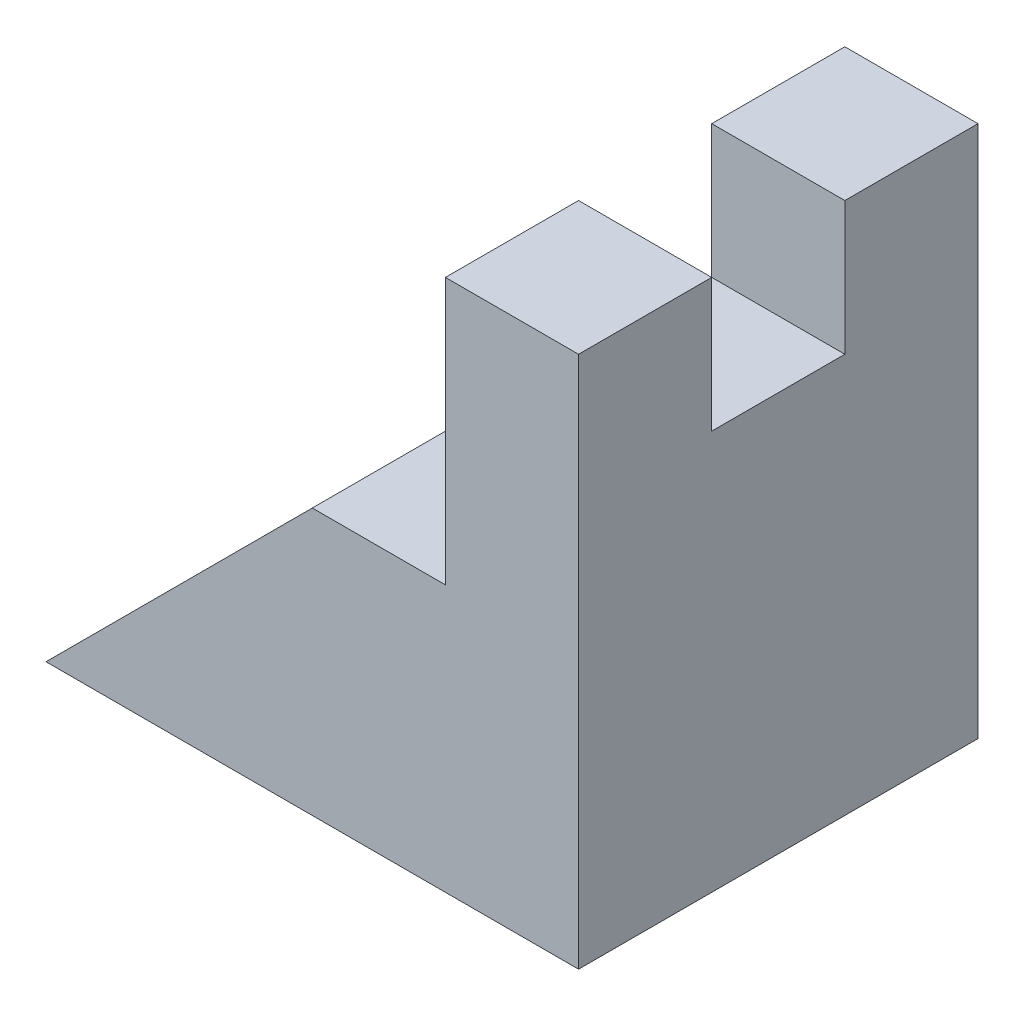
ISO-10303-21;
HEADER;
FILE_DESCRIPTION(('STEP AP214'),'2;1');
FILE_NAME('part.step','',(''),(''),'','','');
FILE_SCHEMA(('AUTOMOTIVE_DESIGN { 1 0 10303 214 1 1 1 1 }'));
ENDSEC;
DATA;
#1=APPLICATION_CONTEXT('core data for automotive mechanical design processes');
#2=APPLICATION_PROTOCOL_DEFINITION('international standard','automotive_design',2000,#1);
#3=PRODUCT_CONTEXT('',#1,'mechanical');
#4=PRODUCT('Part','Part','',(#3));
#5=PRODUCT_RELATED_PRODUCT_CATEGORY('part','',(#4));
#6=PRODUCT_DEFINITION_FORMATION('','',#4);
#7=PRODUCT_DEFINITION_CONTEXT('part definition',#1,'design');
#8=PRODUCT_DEFINITION('design','',#6,#7);
#9=PRODUCT_DEFINITION_SHAPE('','',#8);
#10=(LENGTH_UNIT() NAMED_UNIT(*) SI_UNIT(.MILLI.,.METRE.));
#11=(NAMED_UNIT(*) PLANE_ANGLE_UNIT() SI_UNIT($,.RADIAN.));
#12=(NAMED_UNIT(*) SI_UNIT($,.STERADIAN.) SOLID_ANGLE_UNIT());
#13=UNCERTAINTY_MEASURE_WITH_UNIT(LENGTH_MEASURE(1.E-05),#10,'distance_accuracy_value','');
#14=(GEOMETRIC_REPRESENTATION_CONTEXT(3) GLOBAL_UNCERTAINTY_ASSIGNED_CONTEXT((#13)) GLOBAL_UNIT_ASSIGNED_CONTEXT((#10,
#11,#12)) REPRESENTATION_CONTEXT('',''));
#15=CARTESIAN_POINT('',(0.,0.,0.));
#16=DIRECTION('',(0.,0.,1.));
#17=DIRECTION('',(1.,0.,0.));
#18=AXIS2_PLACEMENT_3D('',#15,#16,#17);
#19=CARTESIAN_POINT('',(30.,40.,15.));
#20=DIRECTION('',(0.,-1.,0.));
#21=DIRECTION('',(0.,0.,-1.));
#22=AXIS2_PLACEMENT_3D('',#19,#20,#21);
#23=PLANE('',#22);
#24=DIRECTION('',(0.,0.,-1.));
#25=VECTOR('',#24,1.);
#26=CARTESIAN_POINT('',(30.,40.,15.));
#27=LINE('',#26,#25);
#28=CARTESIAN_POINT('',(30.,40.,-5.));
#29=VERTEX_POINT('',#28);
#30=CARTESIAN_POINT('',(30.,40.,-15.));
#31=VERTEX_POINT('',#30);
#32=EDGE_CURVE('E125',#29,#31,#27,.T.);
#33=ORIENTED_EDGE('',*,*,#32,.F.);
#34=DIRECTION('',(1.,0.,0.));
#35=VECTOR('',#34,1.);
#36=CARTESIAN_POINT('',(0.,40.,-5.));
#37=LINE('',#36,#35);
#38=CARTESIAN_POINT('',(40.,40.,-5.));
#39=VERTEX_POINT('',#38);
#40=EDGE_CURVE('E138',#29,#39,#37,.T.);
#41=ORIENTED_EDGE('',*,*,#40,.T.);
#42=DIRECTION('',(0.,0.,-1.));
#43=VECTOR('',#42,1.);
#44=CARTESIAN_POINT('',(40.,40.,15.));
#45=LINE('',#44,#43);
#46=CARTESIAN_POINT('',(40.,40.,-15.));
#47=VERTEX_POINT('',#46);
#48=EDGE_CURVE('E153',#39,#47,#45,.T.);
#49=ORIENTED_EDGE('',*,*,#48,.T.);
#50=DIRECTION('',(-1.,0.,0.));
#51=VECTOR('',#50,1.);
#52=CARTESIAN_POINT('',(30.,40.,-15.));
#53=LINE('',#52,#51);
#54=EDGE_CURVE('E141',#47,#31,#53,.T.);
#55=ORIENTED_EDGE('',*,*,#54,.T.);
#56=EDGE_LOOP('',(#33,#41,#49,#55));
#57=FACE_BOUND('',#56,.T.);
#58=ADVANCED_FACE('F36',(#57),#23,.F.);
#59=CARTESIAN_POINT('',(40.,0.,15.));
#60=DIRECTION('',(0.,1.,0.));
#61=DIRECTION('',(0.,0.,1.));
#62=AXIS2_PLACEMENT_3D('',#59,#60,#61);
#63=PLANE('',#62);
#64=DIRECTION('',(1.,0.,0.));
#65=VECTOR('',#64,1.);
#66=CARTESIAN_POINT('',(40.,0.,-15.));
#67=LINE('',#66,#65);
#68=CARTESIAN_POINT('',(0.,0.,-15.));
#69=VERTEX_POINT('',#68);
#70=CARTESIAN_POINT('',(40.,0.,-15.));
#71=VERTEX_POINT('',#70);
#72=EDGE_CURVE('E134',#69,#71,#67,.T.);
#73=ORIENTED_EDGE('',*,*,#72,.T.);
#74=DIRECTION('',(0.,0.,-1.));
#75=VECTOR('',#74,1.);
#76=CARTESIAN_POINT('',(40.,0.,15.));
#77=LINE('',#76,#75);
#78=CARTESIAN_POINT('',(40.,0.,15.));
#79=VERTEX_POINT('',#78);
#80=EDGE_CURVE('E157',#79,#71,#77,.T.);
#81=ORIENTED_EDGE('',*,*,#80,.F.);
#82=DIRECTION('',(1.,0.,0.));
#83=VECTOR('',#82,1.);
#84=CARTESIAN_POINT('',(40.,0.,15.));
#85=LINE('',#84,#83);
#86=CARTESIAN_POINT('',(0.,0.,15.));
#87=VERTEX_POINT('',#86);
#88=EDGE_CURVE('E148',#87,#79,#85,.T.);
#89=ORIENTED_EDGE('',*,*,#88,.F.);
#90=DIRECTION('',(0.,0.,-1.));
#91=VECTOR('',#90,1.);
#92=CARTESIAN_POINT('',(0.,0.,15.));
#93=LINE('',#92,#91);
#94=EDGE_CURVE('E130',#87,#69,#93,.T.);
#95=ORIENTED_EDGE('',*,*,#94,.T.);
#96=EDGE_LOOP('',(#73,#81,#89,#95));
#97=FACE_BOUND('',#96,.T.);
#98=ADVANCED_FACE('F38',(#97),#63,.F.);
#99=CARTESIAN_POINT('',(40.,40.,15.));
#100=DIRECTION('',(-1.,0.,0.));
#101=DIRECTION('',(0.,0.,1.));
#102=AXIS2_PLACEMENT_3D('',#99,#100,#101);
#103=PLANE('',#102);
#104=ORIENTED_EDGE('',*,*,#48,.F.);
#105=DIRECTION('',(0.,1.,0.));
#106=VECTOR('',#105,1.);
#107=CARTESIAN_POINT('',(40.,30.,-5.));
#108=LINE('',#107,#106);
#109=CARTESIAN_POINT('',(40.,30.,-5.));
#110=VERTEX_POINT('',#109);
#111=EDGE_CURVE('E187',#110,#39,#108,.T.);
#112=ORIENTED_EDGE('',*,*,#111,.F.);
#113=DIRECTION('',(0.,0.,-1.));
#114=VECTOR('',#113,1.);
#115=CARTESIAN_POINT('',(40.,30.,5.));
#116=LINE('',#115,#114);
#117=CARTESIAN_POINT('',(40.,30.,5.));
#118=VERTEX_POINT('',#117);
#119=EDGE_CURVE('E174',#118,#110,#116,.T.);
#120=ORIENTED_EDGE('',*,*,#119,.F.);
#121=DIRECTION('',(0.,-1.,0.));
#122=VECTOR('',#121,1.);
#123=CARTESIAN_POINT('',(40.,40.,5.));
#124=LINE('',#123,#122);
#125=CARTESIAN_POINT('',(40.,40.,5.));
#126=VERTEX_POINT('',#125);
#127=EDGE_CURVE('E195',#126,#118,#124,.T.);
#128=ORIENTED_EDGE('',*,*,#127,.F.);
#129=CARTESIAN_POINT('',(40.,40.,15.));
#130=VERTEX_POINT('',#129);
#131=EDGE_CURVE('E154',#130,#126,#45,.T.);
#132=ORIENTED_EDGE('',*,*,#131,.F.);
#133=DIRECTION('',(0.,1.,0.));
#134=VECTOR('',#133,1.);
#135=CARTESIAN_POINT('',(40.,40.,15.));
#136=LINE('',#135,#134);
#137=EDGE_CURVE('E96',#79,#130,#136,.T.);
#138=ORIENTED_EDGE('',*,*,#137,.F.);
#139=ORIENTED_EDGE('',*,*,#80,.T.);
#140=DIRECTION('',(0.,1.,0.));
#141=VECTOR('',#140,1.);
#142=CARTESIAN_POINT('',(40.,40.,-15.));
#143=LINE('',#142,#141);
#144=EDGE_CURVE('E137',#71,#47,#143,.T.);
#145=ORIENTED_EDGE('',*,*,#144,.T.);
#146=EDGE_LOOP('',(#104,#112,#120,#128,#132,#138,#139,#145));
#147=FACE_BOUND('',#146,.T.);
#148=ADVANCED_FACE('F193',(#147),#103,.F.);
#149=ORIENTED_EDGE('',*,*,#131,.T.);
#150=DIRECTION('',(1.,0.,0.));
#151=VECTOR('',#150,1.);
#152=CARTESIAN_POINT('',(0.,40.,5.));
#153=LINE('',#152,#151);
#154=CARTESIAN_POINT('',(30.,40.,5.));
#155=VERTEX_POINT('',#154);
#156=EDGE_CURVE('E181',#155,#126,#153,.T.);
#157=ORIENTED_EDGE('',*,*,#156,.F.);
#158=CARTESIAN_POINT('',(30.,40.,15.));
#159=VERTEX_POINT('',#158);
#160=EDGE_CURVE('E151',#159,#155,#27,.T.);
#161=ORIENTED_EDGE('',*,*,#160,.F.);
#162=DIRECTION('',(-1.,0.,0.));
#163=VECTOR('',#162,1.);
#164=CARTESIAN_POINT('',(30.,40.,15.));
#165=LINE('',#164,#163);
#166=EDGE_CURVE('E112',#130,#159,#165,.T.);
#167=ORIENTED_EDGE('',*,*,#166,.F.);
#168=EDGE_LOOP('',(#149,#157,#161,#167));
#169=FACE_BOUND('',#168,.T.);
#170=ADVANCED_FACE('F198',(#169),#23,.F.);
#171=CARTESIAN_POINT('',(30.,20.,15.));
#172=DIRECTION('',(1.,0.,0.));
#173=DIRECTION('',(0.,0.,-1.));
#174=AXIS2_PLACEMENT_3D('',#171,#172,#173);
#175=PLANE('',#174);
#176=DIRECTION('',(0.,0.,-1.));
#177=VECTOR('',#176,1.);
#178=CARTESIAN_POINT('',(30.,30.,15.));
#179=LINE('',#178,#177);
#180=CARTESIAN_POINT('',(30.,30.,5.));
#181=VERTEX_POINT('',#180);
#182=CARTESIAN_POINT('',(30.,30.,-5.));
#183=VERTEX_POINT('',#182);
#184=EDGE_CURVE('E44',#181,#183,#179,.T.);
#185=ORIENTED_EDGE('',*,*,#184,.T.);
#186=DIRECTION('',(0.,1.,0.));
#187=VECTOR('',#186,1.);
#188=CARTESIAN_POINT('',(30.,20.,-5.));
#189=LINE('',#188,#187);
#190=EDGE_CURVE('E11',#183,#29,#189,.T.);
#191=ORIENTED_EDGE('',*,*,#190,.T.);
#192=ORIENTED_EDGE('',*,*,#32,.T.);
#193=DIRECTION('',(0.,-1.,0.));
#194=VECTOR('',#193,1.);
#195=CARTESIAN_POINT('',(30.,20.,-15.));
#196=LINE('',#195,#194);
#197=CARTESIAN_POINT('',(30.,20.,-15.));
#198=VERTEX_POINT('',#197);
#199=EDGE_CURVE('E122',#31,#198,#196,.T.);
#200=ORIENTED_EDGE('',*,*,#199,.T.);
#201=DIRECTION('',(0.,0.,-1.));
#202=VECTOR('',#201,1.);
#203=CARTESIAN_POINT('',(30.,20.,15.));
#204=LINE('',#203,#202);
#205=CARTESIAN_POINT('',(30.,20.,15.));
#206=VERTEX_POINT('',#205);
#207=EDGE_CURVE('E118',#206,#198,#204,.T.);
#208=ORIENTED_EDGE('',*,*,#207,.F.);
#209=DIRECTION('',(0.,-1.,0.));
#210=VECTOR('',#209,1.);
#211=CARTESIAN_POINT('',(30.,20.,15.));
#212=LINE('',#211,#210);
#213=EDGE_CURVE('E105',#159,#206,#212,.T.);
#214=ORIENTED_EDGE('',*,*,#213,.F.);
#215=ORIENTED_EDGE('',*,*,#160,.T.);
#216=DIRECTION('',(0.,-1.,0.));
#217=VECTOR('',#216,1.);
#218=CARTESIAN_POINT('',(30.,20.,5.));
#219=LINE('',#218,#217);
#220=EDGE_CURVE('E159',#155,#181,#219,.T.);
#221=ORIENTED_EDGE('',*,*,#220,.T.);
#222=EDGE_LOOP('',(#185,#191,#192,#200,#208,#214,#215,#221));
#223=FACE_BOUND('',#222,.T.);
#224=ADVANCED_FACE('F120',(#223),#175,.F.);
#225=CARTESIAN_POINT('',(20.0000000000002,20.,15.));
#226=DIRECTION('',(0.,-1.,0.));
#227=DIRECTION('',(0.,0.,-1.));
#228=AXIS2_PLACEMENT_3D('',#225,#226,#227);
#229=PLANE('',#228);
#230=DIRECTION('',(-1.,0.,0.));
#231=VECTOR('',#230,1.);
#232=CARTESIAN_POINT('',(20.0000000000002,20.,-15.));
#233=LINE('',#232,#231);
#234=CARTESIAN_POINT('',(20.0000000000002,20.,-15.));
#235=VERTEX_POINT('',#234);
#236=EDGE_CURVE('E145',#198,#235,#233,.T.);
#237=ORIENTED_EDGE('',*,*,#236,.T.);
#238=DIRECTION('',(0.,0.,-1.));
#239=VECTOR('',#238,1.);
#240=CARTESIAN_POINT('',(20.0000000000002,20.,15.));
#241=LINE('',#240,#239);
#242=CARTESIAN_POINT('',(20.0000000000002,20.,15.));
#243=VERTEX_POINT('',#242);
#244=EDGE_CURVE('E126',#243,#235,#241,.T.);
#245=ORIENTED_EDGE('',*,*,#244,.F.);
#246=DIRECTION('',(-1.,0.,0.));
#247=VECTOR('',#246,1.);
#248=CARTESIAN_POINT('',(20.0000000000002,20.,15.));
#249=LINE('',#248,#247);
#250=EDGE_CURVE('E109',#206,#243,#249,.T.);
#251=ORIENTED_EDGE('',*,*,#250,.F.);
#252=ORIENTED_EDGE('',*,*,#207,.T.);
#253=EDGE_LOOP('',(#237,#245,#251,#252));
#254=FACE_BOUND('',#253,.T.);
#255=ADVANCED_FACE('F128',(#254),#229,.F.);
#256=CARTESIAN_POINT('',(0.,0.,15.));
#257=DIRECTION('',(0.707106781186544,-0.707106781186551,0.));
#258=DIRECTION('',(0.707106781186551,0.707106781186544,0.));
#259=AXIS2_PLACEMENT_3D('',#256,#257,#258);
#260=PLANE('',#259);
#261=DIRECTION('',(-0.707106781186551,-0.707106781186544,0.));
#262=VECTOR('',#261,1.);
#263=CARTESIAN_POINT('',(0.,0.,-15.));
#264=LINE('',#263,#262);
#265=EDGE_CURVE('E87',#235,#69,#264,.T.);
#266=ORIENTED_EDGE('',*,*,#265,.T.);
#267=ORIENTED_EDGE('',*,*,#94,.F.);
#268=DIRECTION('',(-0.707106781186551,-0.707106781186544,0.));
#269=VECTOR('',#268,1.);
#270=CARTESIAN_POINT('',(0.,0.,15.));
#271=LINE('',#270,#269);
#272=EDGE_CURVE('E60',#243,#87,#271,.T.);
#273=ORIENTED_EDGE('',*,*,#272,.F.);
#274=ORIENTED_EDGE('',*,*,#244,.T.);
#275=EDGE_LOOP('',(#266,#267,#273,#274));
#276=FACE_BOUND('',#275,.T.);
#277=ADVANCED_FACE('F215',(#276),#260,.F.);
#278=CARTESIAN_POINT('',(0.,0.,15.));
#279=DIRECTION('',(0.,0.,-1.));
#280=DIRECTION('',(-1.,0.,0.));
#281=AXIS2_PLACEMENT_3D('',#278,#279,#280);
#282=PLANE('',#281);
#283=ORIENTED_EDGE('',*,*,#88,.T.);
#284=ORIENTED_EDGE('',*,*,#137,.T.);
#285=ORIENTED_EDGE('',*,*,#166,.T.);
#286=ORIENTED_EDGE('',*,*,#213,.T.);
#287=ORIENTED_EDGE('',*,*,#250,.T.);
#288=ORIENTED_EDGE('',*,*,#272,.T.);
#289=EDGE_LOOP('',(#283,#284,#285,#286,#287,#288));
#290=FACE_BOUND('',#289,.T.);
#291=ADVANCED_FACE('F107',(#290),#282,.F.);
#292=CARTESIAN_POINT('',(0.,0.,-15.));
#293=DIRECTION('',(0.,0.,-1.));
#294=DIRECTION('',(-1.,0.,0.));
#295=AXIS2_PLACEMENT_3D('',#292,#293,#294);
#296=PLANE('',#295);
#297=ORIENTED_EDGE('',*,*,#72,.F.);
#298=ORIENTED_EDGE('',*,*,#265,.F.);
#299=ORIENTED_EDGE('',*,*,#236,.F.);
#300=ORIENTED_EDGE('',*,*,#199,.F.);
#301=ORIENTED_EDGE('',*,*,#54,.F.);
#302=ORIENTED_EDGE('',*,*,#144,.F.);
#303=EDGE_LOOP('',(#297,#298,#299,#300,#301,#302));
#304=FACE_BOUND('',#303,.T.);
#305=ADVANCED_FACE('F214',(#304),#296,.T.);
#306=CARTESIAN_POINT('',(0.,30.,-5.));
#307=DIRECTION('',(0.,0.,-1.));
#308=DIRECTION('',(0.,1.,0.));
#309=AXIS2_PLACEMENT_3D('',#306,#307,#308);
#310=PLANE('',#309);
#311=DIRECTION('',(1.,0.,0.));
#312=VECTOR('',#311,1.);
#313=CARTESIAN_POINT('',(0.,30.,-5.));
#314=LINE('',#313,#312);
#315=EDGE_CURVE('E171',#183,#110,#314,.T.);
#316=ORIENTED_EDGE('',*,*,#315,.T.);
#317=ORIENTED_EDGE('',*,*,#111,.T.);
#318=ORIENTED_EDGE('',*,*,#40,.F.);
#319=ORIENTED_EDGE('',*,*,#190,.F.);
#320=EDGE_LOOP('',(#316,#317,#318,#319));
#321=FACE_BOUND('',#320,.T.);
#322=ADVANCED_FACE('F209',(#321),#310,.F.);
#323=CARTESIAN_POINT('',(0.,30.,5.));
#324=DIRECTION('',(0.,-1.,0.));
#325=DIRECTION('',(0.,0.,-1.));
#326=AXIS2_PLACEMENT_3D('',#323,#324,#325);
#327=PLANE('',#326);
#328=DIRECTION('',(1.,0.,0.));
#329=VECTOR('',#328,1.);
#330=CARTESIAN_POINT('',(0.,30.,5.));
#331=LINE('',#330,#329);
#332=EDGE_CURVE('E51',#181,#118,#331,.T.);
#333=ORIENTED_EDGE('',*,*,#332,.T.);
#334=ORIENTED_EDGE('',*,*,#119,.T.);
#335=ORIENTED_EDGE('',*,*,#315,.F.);
#336=ORIENTED_EDGE('',*,*,#184,.F.);
#337=EDGE_LOOP('',(#333,#334,#335,#336));
#338=FACE_BOUND('',#337,.T.);
#339=ADVANCED_FACE('F167',(#338),#327,.F.);
#340=CARTESIAN_POINT('',(0.,40.,5.));
#341=DIRECTION('',(0.,0.,1.));
#342=DIRECTION('',(1.,0.,0.));
#343=AXIS2_PLACEMENT_3D('',#340,#341,#342);
#344=PLANE('',#343);
#345=ORIENTED_EDGE('',*,*,#156,.T.);
#346=ORIENTED_EDGE('',*,*,#127,.T.);
#347=ORIENTED_EDGE('',*,*,#332,.F.);
#348=ORIENTED_EDGE('',*,*,#220,.F.);
#349=EDGE_LOOP('',(#345,#346,#347,#348));
#350=FACE_BOUND('',#349,.T.);
#351=ADVANCED_FACE('F205',(#350),#344,.F.);
#352=CLOSED_SHELL('',(#58,#98,#148,#170,#224,#255,#277,#291,#305,#322,#339,#351));
#353=MANIFOLD_SOLID_BREP('B2',#352);
#354=ADVANCED_BREP_SHAPE_REPRESENTATION('',(#18,#353),#14);
#355=SHAPE_DEFINITION_REPRESENTATION(#9,#354);
ENDSEC;
END-ISO-10303-21;
